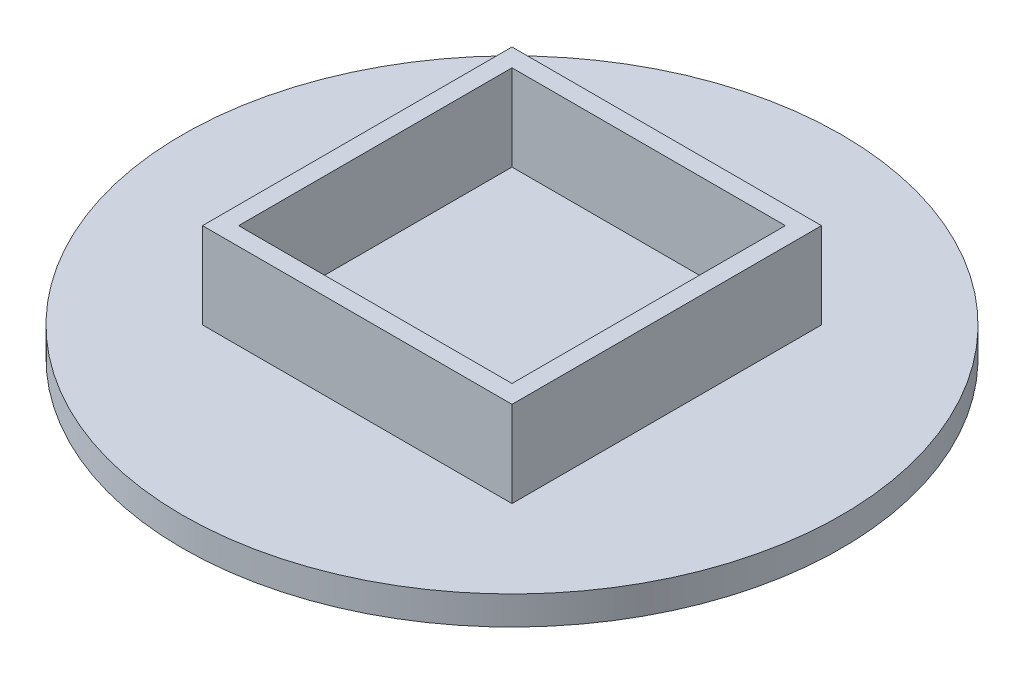
ISO-10303-21;
HEADER;
FILE_DESCRIPTION(('STEP AP214'),'2;1');
FILE_NAME('part.step','',(''),(''),'','','');
FILE_SCHEMA(('AUTOMOTIVE_DESIGN { 1 0 10303 214 1 1 1 1 }'));
ENDSEC;
DATA;
#1=APPLICATION_CONTEXT('core data for automotive mechanical design processes');
#2=APPLICATION_PROTOCOL_DEFINITION('international standard','automotive_design',2000,#1);
#3=PRODUCT_CONTEXT('',#1,'mechanical');
#4=PRODUCT('Part','Part','',(#3));
#5=PRODUCT_RELATED_PRODUCT_CATEGORY('part','',(#4));
#6=PRODUCT_DEFINITION_FORMATION('','',#4);
#7=PRODUCT_DEFINITION_CONTEXT('part definition',#1,'design');
#8=PRODUCT_DEFINITION('design','',#6,#7);
#9=PRODUCT_DEFINITION_SHAPE('','',#8);
#10=(LENGTH_UNIT() NAMED_UNIT(*) SI_UNIT(.MILLI.,.METRE.));
#11=(NAMED_UNIT(*) PLANE_ANGLE_UNIT() SI_UNIT($,.RADIAN.));
#12=(NAMED_UNIT(*) SI_UNIT($,.STERADIAN.) SOLID_ANGLE_UNIT());
#13=UNCERTAINTY_MEASURE_WITH_UNIT(LENGTH_MEASURE(1.E-05),#10,'distance_accuracy_value','');
#14=(GEOMETRIC_REPRESENTATION_CONTEXT(3) GLOBAL_UNCERTAINTY_ASSIGNED_CONTEXT((#13)) GLOBAL_UNIT_ASSIGNED_CONTEXT((#10,
#11,#12)) REPRESENTATION_CONTEXT('',''));
#15=CARTESIAN_POINT('',(0.,0.,0.));
#16=DIRECTION('',(0.,0.,1.));
#17=DIRECTION('',(1.,0.,0.));
#18=AXIS2_PLACEMENT_3D('',#15,#16,#17);
#19=CARTESIAN_POINT('',(0.,25.4,-30.29));
#20=DIRECTION('',(0.,0.,-1.));
#21=DIRECTION('',(-1.,0.,0.));
#22=AXIS2_PLACEMENT_3D('',#19,#20,#21);
#23=PLANE('',#22);
#24=DIRECTION('',(0.,-1.,0.));
#25=VECTOR('',#24,1.);
#26=CARTESIAN_POINT('',(-30.2900000000001,25.4,-30.29));
#27=LINE('',#26,#25);
#28=CARTESIAN_POINT('',(-30.2900000000001,25.4,-30.29));
#29=VERTEX_POINT('',#28);
#30=CARTESIAN_POINT('',(-30.2900000000001,6.35,-30.29));
#31=VERTEX_POINT('',#30);
#32=EDGE_CURVE('E119',#29,#31,#27,.T.);
#33=ORIENTED_EDGE('',*,*,#32,.T.);
#34=DIRECTION('',(1.,0.,0.));
#35=VECTOR('',#34,1.);
#36=CARTESIAN_POINT('',(0.,6.35,-30.29));
#37=LINE('',#36,#35);
#38=CARTESIAN_POINT('',(30.29,6.35,-30.29));
#39=VERTEX_POINT('',#38);
#40=EDGE_CURVE('E57',#31,#39,#37,.T.);
#41=ORIENTED_EDGE('',*,*,#40,.T.);
#42=DIRECTION('',(0.,-1.,0.));
#43=VECTOR('',#42,1.);
#44=CARTESIAN_POINT('',(30.29,25.4,-30.29));
#45=LINE('',#44,#43);
#46=CARTESIAN_POINT('',(30.29,25.4,-30.29));
#47=VERTEX_POINT('',#46);
#48=EDGE_CURVE('E50',#47,#39,#45,.T.);
#49=ORIENTED_EDGE('',*,*,#48,.F.);
#50=DIRECTION('',(1.,0.,0.));
#51=VECTOR('',#50,1.);
#52=CARTESIAN_POINT('',(0.,25.4,-30.29));
#53=LINE('',#52,#51);
#54=EDGE_CURVE('E162',#29,#47,#53,.T.);
#55=ORIENTED_EDGE('',*,*,#54,.F.);
#56=EDGE_LOOP('',(#33,#41,#49,#55));
#57=FACE_BOUND('',#56,.T.);
#58=ADVANCED_FACE('F41',(#57),#23,.F.);
#59=CARTESIAN_POINT('',(30.29,25.4,0.));
#60=DIRECTION('',(1.,0.,0.));
#61=DIRECTION('',(0.,0.,-1.));
#62=AXIS2_PLACEMENT_3D('',#59,#60,#61);
#63=PLANE('',#62);
#64=ORIENTED_EDGE('',*,*,#48,.T.);
#65=DIRECTION('',(0.,0.,1.));
#66=VECTOR('',#65,1.);
#67=CARTESIAN_POINT('',(30.29,6.35,0.));
#68=LINE('',#67,#66);
#69=CARTESIAN_POINT('',(30.29,6.35,30.29));
#70=VERTEX_POINT('',#69);
#71=EDGE_CURVE('E64',#39,#70,#68,.T.);
#72=ORIENTED_EDGE('',*,*,#71,.T.);
#73=DIRECTION('',(0.,-1.,0.));
#74=VECTOR('',#73,1.);
#75=CARTESIAN_POINT('',(30.29,25.4,30.29));
#76=LINE('',#75,#74);
#77=CARTESIAN_POINT('',(30.29,25.4,30.29));
#78=VERTEX_POINT('',#77);
#79=EDGE_CURVE('E118',#78,#70,#76,.T.);
#80=ORIENTED_EDGE('',*,*,#79,.F.);
#81=DIRECTION('',(0.,0.,1.));
#82=VECTOR('',#81,1.);
#83=CARTESIAN_POINT('',(30.29,25.4,0.));
#84=LINE('',#83,#82);
#85=EDGE_CURVE('E166',#47,#78,#84,.T.);
#86=ORIENTED_EDGE('',*,*,#85,.F.);
#87=EDGE_LOOP('',(#64,#72,#80,#86));
#88=FACE_BOUND('',#87,.T.);
#89=ADVANCED_FACE('F223',(#88),#63,.F.);
#90=CARTESIAN_POINT('',(0.,25.4,30.29));
#91=DIRECTION('',(0.,0.,-1.));
#92=DIRECTION('',(-1.,0.,0.));
#93=AXIS2_PLACEMENT_3D('',#90,#91,#92);
#94=PLANE('',#93);
#95=DIRECTION('',(1.,0.,0.));
#96=VECTOR('',#95,1.);
#97=CARTESIAN_POINT('',(0.,6.35,30.29));
#98=LINE('',#97,#96);
#99=CARTESIAN_POINT('',(-30.2900000000001,6.35,30.29));
#100=VERTEX_POINT('',#99);
#101=EDGE_CURVE('E122',#100,#70,#98,.T.);
#102=ORIENTED_EDGE('',*,*,#101,.F.);
#103=DIRECTION('',(0.,-1.,0.));
#104=VECTOR('',#103,1.);
#105=CARTESIAN_POINT('',(-30.2900000000001,25.4,30.29));
#106=LINE('',#105,#104);
#107=CARTESIAN_POINT('',(-30.2900000000001,25.4,30.29));
#108=VERTEX_POINT('',#107);
#109=EDGE_CURVE('E109',#108,#100,#106,.T.);
#110=ORIENTED_EDGE('',*,*,#109,.F.);
#111=DIRECTION('',(1.,0.,0.));
#112=VECTOR('',#111,1.);
#113=CARTESIAN_POINT('',(0.,25.4,30.29));
#114=LINE('',#113,#112);
#115=EDGE_CURVE('E169',#108,#78,#114,.T.);
#116=ORIENTED_EDGE('',*,*,#115,.T.);
#117=ORIENTED_EDGE('',*,*,#79,.T.);
#118=EDGE_LOOP('',(#102,#110,#116,#117));
#119=FACE_BOUND('',#118,.T.);
#120=ADVANCED_FACE('F123',(#119),#94,.T.);
#121=CARTESIAN_POINT('',(34.2900000000001,25.4,0.));
#122=DIRECTION('',(1.,0.,0.));
#123=DIRECTION('',(0.,0.,-1.));
#124=AXIS2_PLACEMENT_3D('',#121,#122,#123);
#125=PLANE('',#124);
#126=DIRECTION('',(0.,0.,1.));
#127=VECTOR('',#126,1.);
#128=CARTESIAN_POINT('',(34.2900000000001,6.35,0.));
#129=LINE('',#128,#127);
#130=CARTESIAN_POINT('',(34.2900000000001,6.35,-34.29));
#131=VERTEX_POINT('',#130);
#132=CARTESIAN_POINT('',(34.2900000000001,6.35,34.29));
#133=VERTEX_POINT('',#132);
#134=EDGE_CURVE('E145',#131,#133,#129,.T.);
#135=ORIENTED_EDGE('',*,*,#134,.F.);
#136=DIRECTION('',(0.,-1.,0.));
#137=VECTOR('',#136,1.);
#138=CARTESIAN_POINT('',(34.2900000000001,25.4,-34.29));
#139=LINE('',#138,#137);
#140=CARTESIAN_POINT('',(34.2900000000001,25.4,-34.29));
#141=VERTEX_POINT('',#140);
#142=EDGE_CURVE('E176',#141,#131,#139,.T.);
#143=ORIENTED_EDGE('',*,*,#142,.F.);
#144=DIRECTION('',(0.,0.,1.));
#145=VECTOR('',#144,1.);
#146=CARTESIAN_POINT('',(34.2900000000001,25.4,0.));
#147=LINE('',#146,#145);
#148=CARTESIAN_POINT('',(34.2900000000001,25.4,34.29));
#149=VERTEX_POINT('',#148);
#150=EDGE_CURVE('E148',#141,#149,#147,.T.);
#151=ORIENTED_EDGE('',*,*,#150,.T.);
#152=DIRECTION('',(0.,-1.,0.));
#153=VECTOR('',#152,1.);
#154=CARTESIAN_POINT('',(34.2900000000001,25.4,34.29));
#155=LINE('',#154,#153);
#156=EDGE_CURVE('E174',#149,#133,#155,.T.);
#157=ORIENTED_EDGE('',*,*,#156,.T.);
#158=EDGE_LOOP('',(#135,#143,#151,#157));
#159=FACE_BOUND('',#158,.T.);
#160=ADVANCED_FACE('F43',(#159),#125,.T.);
#161=CARTESIAN_POINT('',(0.,25.4,-34.29));
#162=DIRECTION('',(0.,0.,-1.));
#163=DIRECTION('',(-1.,0.,0.));
#164=AXIS2_PLACEMENT_3D('',#161,#162,#163);
#165=PLANE('',#164);
#166=DIRECTION('',(1.,0.,0.));
#167=VECTOR('',#166,1.);
#168=CARTESIAN_POINT('',(0.,6.35,-34.29));
#169=LINE('',#168,#167);
#170=CARTESIAN_POINT('',(-34.2900000000002,6.35,-34.29));
#171=VERTEX_POINT('',#170);
#172=EDGE_CURVE('E142',#171,#131,#169,.T.);
#173=ORIENTED_EDGE('',*,*,#172,.F.);
#174=DIRECTION('',(0.,-1.,0.));
#175=VECTOR('',#174,1.);
#176=CARTESIAN_POINT('',(-34.2900000000002,25.4,-34.29));
#177=LINE('',#176,#175);
#178=CARTESIAN_POINT('',(-34.2900000000002,25.4,-34.29));
#179=VERTEX_POINT('',#178);
#180=EDGE_CURVE('E189',#179,#171,#177,.T.);
#181=ORIENTED_EDGE('',*,*,#180,.F.);
#182=DIRECTION('',(1.,0.,0.));
#183=VECTOR('',#182,1.);
#184=CARTESIAN_POINT('',(0.,25.4,-34.29));
#185=LINE('',#184,#183);
#186=EDGE_CURVE('E152',#179,#141,#185,.T.);
#187=ORIENTED_EDGE('',*,*,#186,.T.);
#188=ORIENTED_EDGE('',*,*,#142,.T.);
#189=EDGE_LOOP('',(#173,#181,#187,#188));
#190=FACE_BOUND('',#189,.T.);
#191=ADVANCED_FACE('F196',(#190),#165,.T.);
#192=CARTESIAN_POINT('',(-34.2900000000002,25.4,0.));
#193=DIRECTION('',(1.,0.,0.));
#194=DIRECTION('',(0.,0.,-1.));
#195=AXIS2_PLACEMENT_3D('',#192,#193,#194);
#196=PLANE('',#195);
#197=ORIENTED_EDGE('',*,*,#180,.T.);
#198=DIRECTION('',(0.,0.,1.));
#199=VECTOR('',#198,1.);
#200=CARTESIAN_POINT('',(-34.2900000000002,6.35,0.));
#201=LINE('',#200,#199);
#202=CARTESIAN_POINT('',(-34.2900000000002,6.35,34.29));
#203=VERTEX_POINT('',#202);
#204=EDGE_CURVE('E135',#171,#203,#201,.T.);
#205=ORIENTED_EDGE('',*,*,#204,.T.);
#206=DIRECTION('',(0.,-1.,0.));
#207=VECTOR('',#206,1.);
#208=CARTESIAN_POINT('',(-34.2900000000002,25.4,34.29));
#209=LINE('',#208,#207);
#210=CARTESIAN_POINT('',(-34.2900000000002,25.4,34.29));
#211=VERTEX_POINT('',#210);
#212=EDGE_CURVE('E185',#211,#203,#209,.T.);
#213=ORIENTED_EDGE('',*,*,#212,.F.);
#214=DIRECTION('',(0.,0.,1.));
#215=VECTOR('',#214,1.);
#216=CARTESIAN_POINT('',(-34.2900000000002,25.4,0.));
#217=LINE('',#216,#215);
#218=EDGE_CURVE('E156',#179,#211,#217,.T.);
#219=ORIENTED_EDGE('',*,*,#218,.F.);
#220=EDGE_LOOP('',(#197,#205,#213,#219));
#221=FACE_BOUND('',#220,.T.);
#222=ADVANCED_FACE('F214',(#221),#196,.F.);
#223=CARTESIAN_POINT('',(0.,25.4,34.29));
#224=DIRECTION('',(0.,0.,-1.));
#225=DIRECTION('',(-1.,0.,0.));
#226=AXIS2_PLACEMENT_3D('',#223,#224,#225);
#227=PLANE('',#226);
#228=ORIENTED_EDGE('',*,*,#212,.T.);
#229=DIRECTION('',(1.,0.,0.));
#230=VECTOR('',#229,1.);
#231=CARTESIAN_POINT('',(0.,6.35,34.29));
#232=LINE('',#231,#230);
#233=EDGE_CURVE('E130',#203,#133,#232,.T.);
#234=ORIENTED_EDGE('',*,*,#233,.T.);
#235=ORIENTED_EDGE('',*,*,#156,.F.);
#236=DIRECTION('',(1.,0.,0.));
#237=VECTOR('',#236,1.);
#238=CARTESIAN_POINT('',(0.,25.4,34.29));
#239=LINE('',#238,#237);
#240=EDGE_CURVE('E159',#211,#149,#239,.T.);
#241=ORIENTED_EDGE('',*,*,#240,.F.);
#242=EDGE_LOOP('',(#228,#234,#235,#241));
#243=FACE_BOUND('',#242,.T.);
#244=ADVANCED_FACE('F209',(#243),#227,.F.);
#245=CARTESIAN_POINT('',(-30.2900000000001,25.4,0.));
#246=DIRECTION('',(1.,0.,0.));
#247=DIRECTION('',(0.,0.,-1.));
#248=AXIS2_PLACEMENT_3D('',#245,#246,#247);
#249=PLANE('',#248);
#250=DIRECTION('',(0.,0.,1.));
#251=VECTOR('',#250,1.);
#252=CARTESIAN_POINT('',(-30.2900000000001,6.35,0.));
#253=LINE('',#252,#251);
#254=EDGE_CURVE('E11',#31,#100,#253,.T.);
#255=ORIENTED_EDGE('',*,*,#254,.F.);
#256=ORIENTED_EDGE('',*,*,#32,.F.);
#257=DIRECTION('',(0.,0.,1.));
#258=VECTOR('',#257,1.);
#259=CARTESIAN_POINT('',(-30.2900000000001,25.4,0.));
#260=LINE('',#259,#258);
#261=EDGE_CURVE('E113',#29,#108,#260,.T.);
#262=ORIENTED_EDGE('',*,*,#261,.T.);
#263=ORIENTED_EDGE('',*,*,#109,.T.);
#264=EDGE_LOOP('',(#255,#256,#262,#263));
#265=FACE_BOUND('',#264,.T.);
#266=ADVANCED_FACE('F111',(#265),#249,.T.);
#267=CARTESIAN_POINT('',(0.,25.4,0.));
#268=DIRECTION('',(0.,1.,0.));
#269=DIRECTION('',(0.,0.,1.));
#270=AXIS2_PLACEMENT_3D('',#267,#268,#269);
#271=PLANE('',#270);
#272=ORIENTED_EDGE('',*,*,#150,.F.);
#273=ORIENTED_EDGE('',*,*,#186,.F.);
#274=ORIENTED_EDGE('',*,*,#218,.T.);
#275=ORIENTED_EDGE('',*,*,#240,.T.);
#276=EDGE_LOOP('',(#272,#273,#274,#275));
#277=FACE_BOUND('',#276,.T.);
#278=ORIENTED_EDGE('',*,*,#54,.T.);
#279=ORIENTED_EDGE('',*,*,#85,.T.);
#280=ORIENTED_EDGE('',*,*,#115,.F.);
#281=ORIENTED_EDGE('',*,*,#261,.F.);
#282=EDGE_LOOP('',(#278,#279,#280,#281));
#283=FACE_BOUND('',#282,.T.);
#284=ADVANCED_FACE('F202',(#277,#283),#271,.T.);
#285=CARTESIAN_POINT('',(0.,6.35,0.));
#286=DIRECTION('',(0.,1.,0.));
#287=DIRECTION('',(0.,0.,1.));
#288=AXIS2_PLACEMENT_3D('',#285,#286,#287);
#289=PLANE('',#288);
#290=ORIENTED_EDGE('',*,*,#40,.F.);
#291=ORIENTED_EDGE('',*,*,#254,.T.);
#292=ORIENTED_EDGE('',*,*,#101,.T.);
#293=ORIENTED_EDGE('',*,*,#71,.F.);
#294=EDGE_LOOP('',(#290,#291,#292,#293));
#295=FACE_BOUND('',#294,.T.);
#296=ADVANCED_FACE('F128',(#295),#289,.T.);
#297=CARTESIAN_POINT('',(0.,6.35,0.));
#298=DIRECTION('',(0.,-1.,0.));
#299=DIRECTION('',(0.,0.,-1.));
#300=AXIS2_PLACEMENT_3D('',#297,#298,#299);
#301=CYLINDRICAL_SURFACE('',#300,73.025);
#302=CARTESIAN_POINT('',(0.,6.35,0.));
#303=DIRECTION('',(0.,1.,0.));
#304=DIRECTION('',(0.,0.,1.));
#305=AXIS2_PLACEMENT_3D('',#302,#303,#304);
#306=CIRCLE('',#305,73.025);
#307=CARTESIAN_POINT('',(0.,6.35,73.025));
#308=VERTEX_POINT('',#307);
#309=EDGE_CURVE('E126',#308,#308,#306,.T.);
#310=ORIENTED_EDGE('',*,*,#309,.F.);
#311=EDGE_LOOP('',(#310));
#312=FACE_BOUND('',#311,.T.);
#313=CARTESIAN_POINT('',(0.,0.,0.));
#314=DIRECTION('',(0.,1.,0.));
#315=DIRECTION('',(0.,0.,1.));
#316=AXIS2_PLACEMENT_3D('',#313,#314,#315);
#317=CIRCLE('',#316,73.025);
#318=CARTESIAN_POINT('',(0.,0.,73.025));
#319=VERTEX_POINT('',#318);
#320=EDGE_CURVE('E329',#319,#319,#317,.T.);
#321=ORIENTED_EDGE('',*,*,#320,.T.);
#322=EDGE_LOOP('',(#321));
#323=FACE_BOUND('',#322,.T.);
#324=ADVANCED_FACE('F240',(#312,#323),#301,.T.);
#325=ORIENTED_EDGE('',*,*,#172,.T.);
#326=ORIENTED_EDGE('',*,*,#134,.T.);
#327=ORIENTED_EDGE('',*,*,#233,.F.);
#328=ORIENTED_EDGE('',*,*,#204,.F.);
#329=EDGE_LOOP('',(#325,#326,#327,#328));
#330=FACE_BOUND('',#329,.T.);
#331=ORIENTED_EDGE('',*,*,#309,.T.);
#332=EDGE_LOOP('',(#331));
#333=FACE_BOUND('',#332,.T.);
#334=ADVANCED_FACE('F211',(#330,#333),#289,.T.);
#335=CARTESIAN_POINT('',(0.,0.,0.));
#336=DIRECTION('',(0.,1.,0.));
#337=DIRECTION('',(0.,0.,1.));
#338=AXIS2_PLACEMENT_3D('',#335,#336,#337);
#339=PLANE('',#338);
#340=ORIENTED_EDGE('',*,*,#320,.F.);
#341=EDGE_LOOP('',(#340));
#342=FACE_BOUND('',#341,.T.);
#343=ADVANCED_FACE('F234',(#342),#339,.F.);
#344=CLOSED_SHELL('',(#58,#89,#120,#160,#191,#222,#244,#266,#284,#296,#324,#334,#343));
#345=MANIFOLD_SOLID_BREP('B2',#344);
#346=ADVANCED_BREP_SHAPE_REPRESENTATION('',(#18,#345),#14);
#347=SHAPE_DEFINITION_REPRESENTATION(#9,#346);
ENDSEC;
END-ISO-10303-21;
